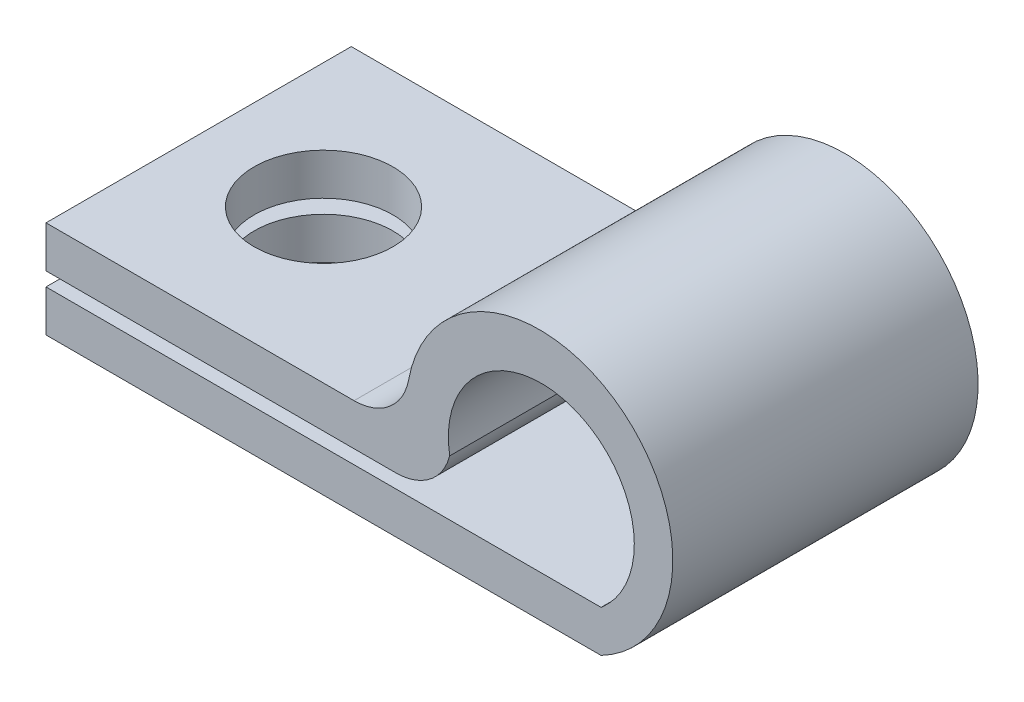
ISO-10303-21;
HEADER;
FILE_DESCRIPTION(('STEP AP214'),'2;1');
FILE_NAME('part.step','',(''),(''),'','','');
FILE_SCHEMA(('AUTOMOTIVE_DESIGN { 1 0 10303 214 1 1 1 1 }'));
ENDSEC;
DATA;
#1=APPLICATION_CONTEXT('core data for automotive mechanical design processes');
#2=APPLICATION_PROTOCOL_DEFINITION('international standard','automotive_design',2000,#1);
#3=PRODUCT_CONTEXT('',#1,'mechanical');
#4=PRODUCT('Part','Part','',(#3));
#5=PRODUCT_RELATED_PRODUCT_CATEGORY('part','',(#4));
#6=PRODUCT_DEFINITION_FORMATION('','',#4);
#7=PRODUCT_DEFINITION_CONTEXT('part definition',#1,'design');
#8=PRODUCT_DEFINITION('design','',#6,#7);
#9=PRODUCT_DEFINITION_SHAPE('','',#8);
#10=(LENGTH_UNIT() NAMED_UNIT(*) SI_UNIT(.MILLI.,.METRE.));
#11=(NAMED_UNIT(*) PLANE_ANGLE_UNIT() SI_UNIT($,.RADIAN.));
#12=(NAMED_UNIT(*) SI_UNIT($,.STERADIAN.) SOLID_ANGLE_UNIT());
#13=UNCERTAINTY_MEASURE_WITH_UNIT(LENGTH_MEASURE(1.E-05),#10,'distance_accuracy_value','');
#14=(GEOMETRIC_REPRESENTATION_CONTEXT(3) GLOBAL_UNCERTAINTY_ASSIGNED_CONTEXT((#13)) GLOBAL_UNIT_ASSIGNED_CONTEXT((#10,
#11,#12)) REPRESENTATION_CONTEXT('',''));
#15=CARTESIAN_POINT('',(0.,0.,0.));
#16=DIRECTION('',(0.,0.,1.));
#17=DIRECTION('',(1.,0.,0.));
#18=AXIS2_PLACEMENT_3D('',#15,#16,#17);
#19=CARTESIAN_POINT('',(0.,2.,11.));
#20=DIRECTION('',(0.,1.,0.));
#21=DIRECTION('',(0.,0.,1.));
#22=AXIS2_PLACEMENT_3D('',#19,#20,#21);
#23=PLANE('',#22);
#24=CARTESIAN_POINT('',(-15.5,2.,5.5));
#25=DIRECTION('',(0.,1.,0.));
#26=DIRECTION('',(0.,0.,1.));
#27=AXIS2_PLACEMENT_3D('',#24,#25,#26);
#28=CIRCLE('',#27,2.5);
#29=CARTESIAN_POINT('',(-15.5,2.,8.));
#30=VERTEX_POINT('',#29);
#31=EDGE_CURVE('E186',#30,#30,#28,.T.);
#32=ORIENTED_EDGE('',*,*,#31,.T.);
#33=EDGE_LOOP('',(#32));
#34=FACE_BOUND('',#33,.T.);
#35=DIRECTION('',(1.,0.,0.));
#36=VECTOR('',#35,1.);
#37=CARTESIAN_POINT('',(0.,2.,0.));
#38=LINE('',#37,#36);
#39=CARTESIAN_POINT('',(-20.,2.,0.));
#40=VERTEX_POINT('',#39);
#41=CARTESIAN_POINT('',(-7.39029966919305,2.,0.));
#42=VERTEX_POINT('',#41);
#43=EDGE_CURVE('E182',#40,#42,#38,.T.);
#44=ORIENTED_EDGE('',*,*,#43,.T.);
#45=DIRECTION('',(0.,0.,-1.));
#46=VECTOR('',#45,1.);
#47=CARTESIAN_POINT('',(-7.39029966919305,2.,11.));
#48=LINE('',#47,#46);
#49=CARTESIAN_POINT('',(-7.39029966919305,2.,11.));
#50=VERTEX_POINT('',#49);
#51=EDGE_CURVE('E123',#42,#50,#48,.F.);
#52=ORIENTED_EDGE('',*,*,#51,.T.);
#53=DIRECTION('',(1.,0.,0.));
#54=VECTOR('',#53,1.);
#55=CARTESIAN_POINT('',(0.,2.,11.));
#56=LINE('',#55,#54);
#57=CARTESIAN_POINT('',(-20.,2.,11.));
#58=VERTEX_POINT('',#57);
#59=EDGE_CURVE('E118',#58,#50,#56,.T.);
#60=ORIENTED_EDGE('',*,*,#59,.F.);
#61=DIRECTION('',(0.,0.,-1.));
#62=VECTOR('',#61,1.);
#63=CARTESIAN_POINT('',(-20.,2.,11.));
#64=LINE('',#63,#62);
#65=EDGE_CURVE('E176',#58,#40,#64,.T.);
#66=ORIENTED_EDGE('',*,*,#65,.T.);
#67=EDGE_LOOP('',(#44,#52,#60,#66));
#68=FACE_BOUND('',#67,.T.);
#69=ADVANCED_FACE('F35',(#34,#68),#23,.F.);
#70=CARTESIAN_POINT('',(-2.15217822005377,4.06722202178273,11.));
#71=DIRECTION('',(0.,0.,-1.));
#72=DIRECTION('',(-1.,0.,0.));
#73=AXIS2_PLACEMENT_3D('',#70,#71,#72);
#74=CYLINDRICAL_SURFACE('',#73,3.35);
#75=CARTESIAN_POINT('',(-2.15217822005377,4.06722202178273,0.));
#76=DIRECTION('',(0.,0.,1.));
#77=DIRECTION('',(1.,0.,0.));
#78=AXIS2_PLACEMENT_3D('',#75,#76,#77);
#79=CIRCLE('',#78,3.35);
#80=CARTESIAN_POINT('',(-5.45380799608934,3.5,0.));
#81=VERTEX_POINT('',#80);
#82=CARTESIAN_POINT('',(0.,1.5,0.));
#83=VERTEX_POINT('',#82);
#84=EDGE_CURVE('E185',#81,#83,#79,.F.);
#85=ORIENTED_EDGE('',*,*,#84,.T.);
#86=DIRECTION('',(0.,0.,-1.));
#87=VECTOR('',#86,1.);
#88=CARTESIAN_POINT('',(0.,1.5,11.));
#89=LINE('',#88,#87);
#90=CARTESIAN_POINT('',(0.,1.5,11.));
#91=VERTEX_POINT('',#90);
#92=EDGE_CURVE('E131',#91,#83,#89,.T.);
#93=ORIENTED_EDGE('',*,*,#92,.F.);
#94=CARTESIAN_POINT('',(-2.15217822005377,4.06722202178273,11.));
#95=DIRECTION('',(0.,0.,1.));
#96=DIRECTION('',(1.,0.,0.));
#97=AXIS2_PLACEMENT_3D('',#94,#95,#96);
#98=CIRCLE('',#97,3.35);
#99=CARTESIAN_POINT('',(-5.45380799608934,3.5,11.));
#100=VERTEX_POINT('',#99);
#101=EDGE_CURVE('E114',#100,#91,#98,.F.);
#102=ORIENTED_EDGE('',*,*,#101,.F.);
#103=DIRECTION('',(0.,0.,-1.));
#104=VECTOR('',#103,1.);
#105=CARTESIAN_POINT('',(-5.45380799608934,3.5,11.));
#106=LINE('',#105,#104);
#107=EDGE_CURVE('E128',#100,#81,#106,.T.);
#108=ORIENTED_EDGE('',*,*,#107,.T.);
#109=EDGE_LOOP('',(#85,#93,#102,#108));
#110=FACE_BOUND('',#109,.T.);
#111=ADVANCED_FACE('F127',(#110),#74,.F.);
#112=CARTESIAN_POINT('',(0.,1.5,11.));
#113=DIRECTION('',(0.,-1.,0.));
#114=DIRECTION('',(1.,0.,0.));
#115=AXIS2_PLACEMENT_3D('',#112,#113,#114);
#116=PLANE('',#115);
#117=CARTESIAN_POINT('',(-15.5,1.5,5.5));
#118=DIRECTION('',(0.,-1.,0.));
#119=DIRECTION('',(1.,0.,0.));
#120=AXIS2_PLACEMENT_3D('',#117,#118,#119);
#121=CIRCLE('',#120,2.5);
#122=CARTESIAN_POINT('',(-13.,1.5,5.5));
#123=VERTEX_POINT('',#122);
#124=EDGE_CURVE('E145',#123,#123,#121,.T.);
#125=ORIENTED_EDGE('',*,*,#124,.T.);
#126=EDGE_LOOP('',(#125));
#127=FACE_BOUND('',#126,.T.);
#128=DIRECTION('',(-1.,0.,0.));
#129=VECTOR('',#128,1.);
#130=CARTESIAN_POINT('',(0.,1.5,0.));
#131=LINE('',#130,#129);
#132=CARTESIAN_POINT('',(-20.,1.5,0.));
#133=VERTEX_POINT('',#132);
#134=EDGE_CURVE('E188',#83,#133,#131,.T.);
#135=ORIENTED_EDGE('',*,*,#134,.T.);
#136=DIRECTION('',(0.,0.,-1.));
#137=VECTOR('',#136,1.);
#138=CARTESIAN_POINT('',(-20.,1.5,11.));
#139=LINE('',#138,#137);
#140=CARTESIAN_POINT('',(-20.,1.5,11.));
#141=VERTEX_POINT('',#140);
#142=EDGE_CURVE('E139',#141,#133,#139,.T.);
#143=ORIENTED_EDGE('',*,*,#142,.F.);
#144=DIRECTION('',(-1.,0.,0.));
#145=VECTOR('',#144,1.);
#146=CARTESIAN_POINT('',(0.,1.5,11.));
#147=LINE('',#146,#145);
#148=EDGE_CURVE('E133',#91,#141,#147,.T.);
#149=ORIENTED_EDGE('',*,*,#148,.F.);
#150=ORIENTED_EDGE('',*,*,#92,.T.);
#151=EDGE_LOOP('',(#135,#143,#149,#150));
#152=FACE_BOUND('',#151,.T.);
#153=ADVANCED_FACE('F211',(#127,#152),#116,.F.);
#154=CARTESIAN_POINT('',(-20.,0.,11.));
#155=DIRECTION('',(-1.,0.,0.));
#156=DIRECTION('',(0.,0.,1.));
#157=AXIS2_PLACEMENT_3D('',#154,#155,#156);
#158=PLANE('',#157);
#159=DIRECTION('',(0.,1.,0.));
#160=VECTOR('',#159,1.);
#161=CARTESIAN_POINT('',(-20.,0.,0.));
#162=LINE('',#161,#160);
#163=CARTESIAN_POINT('',(-20.,0.,0.));
#164=VERTEX_POINT('',#163);
#165=EDGE_CURVE('E191',#164,#133,#162,.T.);
#166=ORIENTED_EDGE('',*,*,#165,.F.);
#167=DIRECTION('',(0.,0.,-1.));
#168=VECTOR('',#167,1.);
#169=CARTESIAN_POINT('',(-20.,0.,11.));
#170=LINE('',#169,#168);
#171=CARTESIAN_POINT('',(-20.,0.,11.));
#172=VERTEX_POINT('',#171);
#173=EDGE_CURVE('E201',#172,#164,#170,.T.);
#174=ORIENTED_EDGE('',*,*,#173,.F.);
#175=DIRECTION('',(0.,1.,0.));
#176=VECTOR('',#175,1.);
#177=CARTESIAN_POINT('',(-20.,0.,11.));
#178=LINE('',#177,#176);
#179=EDGE_CURVE('E208',#172,#141,#178,.T.);
#180=ORIENTED_EDGE('',*,*,#179,.T.);
#181=ORIENTED_EDGE('',*,*,#142,.T.);
#182=EDGE_LOOP('',(#166,#174,#180,#181));
#183=FACE_BOUND('',#182,.T.);
#184=ADVANCED_FACE('F206',(#183),#158,.T.);
#185=CARTESIAN_POINT('',(0.,0.,11.));
#186=DIRECTION('',(0.,-1.,0.));
#187=DIRECTION('',(1.,0.,0.));
#188=AXIS2_PLACEMENT_3D('',#185,#186,#187);
#189=PLANE('',#188);
#190=CARTESIAN_POINT('',(-15.5,0.,5.5));
#191=DIRECTION('',(0.,-1.,0.));
#192=DIRECTION('',(1.,0.,0.));
#193=AXIS2_PLACEMENT_3D('',#190,#191,#192);
#194=CIRCLE('',#193,2.5);
#195=CARTESIAN_POINT('',(-13.,0.,5.5));
#196=VERTEX_POINT('',#195);
#197=EDGE_CURVE('E146',#196,#196,#194,.T.);
#198=ORIENTED_EDGE('',*,*,#197,.F.);
#199=EDGE_LOOP('',(#198));
#200=FACE_BOUND('',#199,.T.);
#201=DIRECTION('',(-1.,0.,0.));
#202=VECTOR('',#201,1.);
#203=CARTESIAN_POINT('',(0.,0.,0.));
#204=LINE('',#203,#202);
#205=CARTESIAN_POINT('',(0.,0.,0.));
#206=VERTEX_POINT('',#205);
#207=EDGE_CURVE('E166',#206,#164,#204,.T.);
#208=ORIENTED_EDGE('',*,*,#207,.F.);
#209=DIRECTION('',(0.,0.,-1.));
#210=VECTOR('',#209,1.);
#211=CARTESIAN_POINT('',(0.,0.,11.));
#212=LINE('',#211,#210);
#213=CARTESIAN_POINT('',(0.,0.,11.));
#214=VERTEX_POINT('',#213);
#215=EDGE_CURVE('E164',#214,#206,#212,.T.);
#216=ORIENTED_EDGE('',*,*,#215,.F.);
#217=DIRECTION('',(-1.,0.,0.));
#218=VECTOR('',#217,1.);
#219=CARTESIAN_POINT('',(0.,0.,11.));
#220=LINE('',#219,#218);
#221=EDGE_CURVE('E178',#214,#172,#220,.T.);
#222=ORIENTED_EDGE('',*,*,#221,.T.);
#223=ORIENTED_EDGE('',*,*,#173,.T.);
#224=EDGE_LOOP('',(#208,#216,#222,#223));
#225=FACE_BOUND('',#224,.T.);
#226=ADVANCED_FACE('F213',(#200,#225),#189,.T.);
#227=CARTESIAN_POINT('',(-2.21416599914087,4.25881074106945,11.));
#228=DIRECTION('',(0.,0.,-1.));
#229=DIRECTION('',(-1.,0.,0.));
#230=AXIS2_PLACEMENT_3D('',#227,#228,#229);
#231=CYLINDRICAL_SURFACE('',#230,4.8);
#232=CARTESIAN_POINT('',(-2.21416599914087,4.25881074106945,0.));
#233=DIRECTION('',(0.,0.,1.));
#234=DIRECTION('',(1.,0.,0.));
#235=AXIS2_PLACEMENT_3D('',#232,#233,#234);
#236=CIRCLE('',#235,4.8);
#237=CARTESIAN_POINT('',(-6.93352929565872,5.13494433560866,0.));
#238=VERTEX_POINT('',#237);
#239=EDGE_CURVE('E155',#238,#206,#236,.F.);
#240=ORIENTED_EDGE('',*,*,#239,.F.);
#241=DIRECTION('',(0.,0.,-1.));
#242=VECTOR('',#241,1.);
#243=CARTESIAN_POINT('',(-6.93352929565872,5.13494433560866,11.));
#244=LINE('',#243,#242);
#245=CARTESIAN_POINT('',(-6.93352929565872,5.13494433560866,11.));
#246=VERTEX_POINT('',#245);
#247=EDGE_CURVE('E56',#238,#246,#244,.F.);
#248=ORIENTED_EDGE('',*,*,#247,.T.);
#249=CARTESIAN_POINT('',(-2.21416599914087,4.25881074106945,11.));
#250=DIRECTION('',(0.,0.,1.));
#251=DIRECTION('',(1.,0.,0.));
#252=AXIS2_PLACEMENT_3D('',#249,#250,#251);
#253=CIRCLE('',#252,4.8);
#254=EDGE_CURVE('E174',#246,#214,#253,.F.);
#255=ORIENTED_EDGE('',*,*,#254,.T.);
#256=ORIENTED_EDGE('',*,*,#215,.T.);
#257=EDGE_LOOP('',(#240,#248,#255,#256));
#258=FACE_BOUND('',#257,.T.);
#259=ADVANCED_FACE('F162',(#258),#231,.T.);
#260=CARTESIAN_POINT('',(0.,3.5,11.));
#261=DIRECTION('',(0.,1.,0.));
#262=DIRECTION('',(0.,0.,1.));
#263=AXIS2_PLACEMENT_3D('',#260,#261,#262);
#264=PLANE('',#263);
#265=CARTESIAN_POINT('',(-15.5,3.5,5.5));
#266=DIRECTION('',(0.,1.,0.));
#267=DIRECTION('',(0.,0.,1.));
#268=AXIS2_PLACEMENT_3D('',#265,#266,#267);
#269=CIRCLE('',#268,2.5);
#270=CARTESIAN_POINT('',(-15.5,3.5,8.));
#271=VERTEX_POINT('',#270);
#272=EDGE_CURVE('E143',#271,#271,#269,.T.);
#273=ORIENTED_EDGE('',*,*,#272,.F.);
#274=EDGE_LOOP('',(#273));
#275=FACE_BOUND('',#274,.T.);
#276=DIRECTION('',(1.,0.,0.));
#277=VECTOR('',#276,1.);
#278=CARTESIAN_POINT('',(0.,3.5,11.));
#279=LINE('',#278,#277);
#280=CARTESIAN_POINT('',(-20.,3.5,11.));
#281=VERTEX_POINT('',#280);
#282=CARTESIAN_POINT('',(-8.89993066920782,3.5,11.));
#283=VERTEX_POINT('',#282);
#284=EDGE_CURVE('E170',#281,#283,#279,.T.);
#285=ORIENTED_EDGE('',*,*,#284,.T.);
#286=DIRECTION('',(0.,0.,1.));
#287=VECTOR('',#286,1.);
#288=CARTESIAN_POINT('',(-8.89993066920782,3.5,0.));
#289=LINE('',#288,#287);
#290=CARTESIAN_POINT('',(-8.89993066920782,3.5,0.));
#291=VERTEX_POINT('',#290);
#292=EDGE_CURVE('E122',#283,#291,#289,.F.);
#293=ORIENTED_EDGE('',*,*,#292,.T.);
#294=DIRECTION('',(1.,0.,0.));
#295=VECTOR('',#294,1.);
#296=CARTESIAN_POINT('',(0.,3.5,0.));
#297=LINE('',#296,#295);
#298=CARTESIAN_POINT('',(-20.,3.5,0.));
#299=VERTEX_POINT('',#298);
#300=EDGE_CURVE('E159',#299,#291,#297,.T.);
#301=ORIENTED_EDGE('',*,*,#300,.F.);
#302=DIRECTION('',(0.,0.,-1.));
#303=VECTOR('',#302,1.);
#304=CARTESIAN_POINT('',(-20.,3.5,11.));
#305=LINE('',#304,#303);
#306=EDGE_CURVE('E171',#281,#299,#305,.T.);
#307=ORIENTED_EDGE('',*,*,#306,.F.);
#308=EDGE_LOOP('',(#285,#293,#301,#307));
#309=FACE_BOUND('',#308,.T.);
#310=ADVANCED_FACE('F169',(#275,#309),#264,.T.);
#311=CARTESIAN_POINT('',(-20.,0.,11.));
#312=DIRECTION('',(-1.,0.,0.));
#313=DIRECTION('',(0.,0.,1.));
#314=AXIS2_PLACEMENT_3D('',#311,#312,#313);
#315=PLANE('',#314);
#316=DIRECTION('',(0.,1.,0.));
#317=VECTOR('',#316,1.);
#318=CARTESIAN_POINT('',(-20.,0.,0.));
#319=LINE('',#318,#317);
#320=EDGE_CURVE('E196',#40,#299,#319,.T.);
#321=ORIENTED_EDGE('',*,*,#320,.F.);
#322=ORIENTED_EDGE('',*,*,#65,.F.);
#323=DIRECTION('',(0.,1.,0.));
#324=VECTOR('',#323,1.);
#325=CARTESIAN_POINT('',(-20.,0.,11.));
#326=LINE('',#325,#324);
#327=EDGE_CURVE('E173',#58,#281,#326,.T.);
#328=ORIENTED_EDGE('',*,*,#327,.T.);
#329=ORIENTED_EDGE('',*,*,#306,.T.);
#330=EDGE_LOOP('',(#321,#322,#328,#329));
#331=FACE_BOUND('',#330,.T.);
#332=ADVANCED_FACE('F262',(#331),#315,.T.);
#333=CARTESIAN_POINT('',(0.,0.,11.));
#334=DIRECTION('',(0.,0.,1.));
#335=DIRECTION('',(1.,0.,0.));
#336=AXIS2_PLACEMENT_3D('',#333,#334,#335);
#337=PLANE('',#336);
#338=ORIENTED_EDGE('',*,*,#59,.T.);
#339=CARTESIAN_POINT('',(-7.39029966919305,4.,11.));
#340=DIRECTION('',(0.,0.,1.));
#341=DIRECTION('',(1.,0.,0.));
#342=AXIS2_PLACEMENT_3D('',#339,#340,#341);
#343=CIRCLE('',#342,2.);
#344=EDGE_CURVE('E111',#50,#100,#343,.T.);
#345=ORIENTED_EDGE('',*,*,#344,.T.);
#346=ORIENTED_EDGE('',*,*,#101,.T.);
#347=ORIENTED_EDGE('',*,*,#148,.T.);
#348=ORIENTED_EDGE('',*,*,#179,.F.);
#349=ORIENTED_EDGE('',*,*,#221,.F.);
#350=ORIENTED_EDGE('',*,*,#254,.F.);
#351=CARTESIAN_POINT('',(-8.89993066920782,5.5,11.));
#352=DIRECTION('',(0.,0.,1.));
#353=DIRECTION('',(1.,0.,0.));
#354=AXIS2_PLACEMENT_3D('',#351,#352,#353);
#355=CIRCLE('',#354,2.);
#356=EDGE_CURVE('E11',#246,#283,#355,.F.);
#357=ORIENTED_EDGE('',*,*,#356,.T.);
#358=ORIENTED_EDGE('',*,*,#284,.F.);
#359=ORIENTED_EDGE('',*,*,#327,.F.);
#360=EDGE_LOOP('',(#338,#345,#346,#347,#348,#349,#350,#357,#358,#359));
#361=FACE_BOUND('',#360,.T.);
#362=ADVANCED_FACE('F113',(#361),#337,.T.);
#363=CARTESIAN_POINT('',(0.,0.,0.));
#364=DIRECTION('',(0.,0.,1.));
#365=DIRECTION('',(1.,0.,0.));
#366=AXIS2_PLACEMENT_3D('',#363,#364,#365);
#367=PLANE('',#366);
#368=ORIENTED_EDGE('',*,*,#84,.F.);
#369=CARTESIAN_POINT('',(-7.39029966919305,4.,0.));
#370=DIRECTION('',(0.,0.,1.));
#371=DIRECTION('',(1.,0.,0.));
#372=AXIS2_PLACEMENT_3D('',#369,#370,#371);
#373=CIRCLE('',#372,2.);
#374=EDGE_CURVE('E136',#81,#42,#373,.F.);
#375=ORIENTED_EDGE('',*,*,#374,.T.);
#376=ORIENTED_EDGE('',*,*,#43,.F.);
#377=ORIENTED_EDGE('',*,*,#320,.T.);
#378=ORIENTED_EDGE('',*,*,#300,.T.);
#379=CARTESIAN_POINT('',(-8.89993066920782,5.5,0.));
#380=DIRECTION('',(0.,0.,1.));
#381=DIRECTION('',(1.,0.,0.));
#382=AXIS2_PLACEMENT_3D('',#379,#380,#381);
#383=CIRCLE('',#382,2.);
#384=EDGE_CURVE('E43',#291,#238,#383,.T.);
#385=ORIENTED_EDGE('',*,*,#384,.T.);
#386=ORIENTED_EDGE('',*,*,#239,.T.);
#387=ORIENTED_EDGE('',*,*,#207,.T.);
#388=ORIENTED_EDGE('',*,*,#165,.T.);
#389=ORIENTED_EDGE('',*,*,#134,.F.);
#390=EDGE_LOOP('',(#368,#375,#376,#377,#378,#385,#386,#387,#388,#389));
#391=FACE_BOUND('',#390,.T.);
#392=ADVANCED_FACE('F153',(#391),#367,.F.);
#393=CARTESIAN_POINT('',(-15.5,9.05881074106945,5.5));
#394=DIRECTION('',(0.,-1.,0.));
#395=DIRECTION('',(1.,0.,0.));
#396=AXIS2_PLACEMENT_3D('',#393,#394,#395);
#397=CYLINDRICAL_SURFACE('',#396,2.5);
#398=ORIENTED_EDGE('',*,*,#272,.T.);
#399=EDGE_LOOP('',(#398));
#400=FACE_BOUND('',#399,.T.);
#401=ORIENTED_EDGE('',*,*,#31,.F.);
#402=EDGE_LOOP('',(#401));
#403=FACE_BOUND('',#402,.T.);
#404=ADVANCED_FACE('F254',(#400,#403),#397,.F.);
#405=ORIENTED_EDGE('',*,*,#197,.T.);
#406=EDGE_LOOP('',(#405));
#407=FACE_BOUND('',#406,.T.);
#408=ORIENTED_EDGE('',*,*,#124,.F.);
#409=EDGE_LOOP('',(#408));
#410=FACE_BOUND('',#409,.T.);
#411=ADVANCED_FACE('F227',(#407,#410),#397,.F.);
#412=CARTESIAN_POINT('',(-7.39029966919305,4.,11.));
#413=DIRECTION('',(0.,0.,-1.));
#414=DIRECTION('',(-1.,0.,0.));
#415=AXIS2_PLACEMENT_3D('',#412,#413,#414);
#416=CYLINDRICAL_SURFACE('',#415,2.);
#417=ORIENTED_EDGE('',*,*,#344,.F.);
#418=ORIENTED_EDGE('',*,*,#51,.F.);
#419=ORIENTED_EDGE('',*,*,#374,.F.);
#420=ORIENTED_EDGE('',*,*,#107,.F.);
#421=EDGE_LOOP('',(#417,#418,#419,#420));
#422=FACE_BOUND('',#421,.T.);
#423=ADVANCED_FACE('F135',(#422),#416,.T.);
#424=CARTESIAN_POINT('',(-8.89993066920782,5.5,11.));
#425=DIRECTION('',(0.,0.,-1.));
#426=DIRECTION('',(-1.,0.,0.));
#427=AXIS2_PLACEMENT_3D('',#424,#425,#426);
#428=CYLINDRICAL_SURFACE('',#427,2.);
#429=ORIENTED_EDGE('',*,*,#356,.F.);
#430=ORIENTED_EDGE('',*,*,#247,.F.);
#431=ORIENTED_EDGE('',*,*,#384,.F.);
#432=ORIENTED_EDGE('',*,*,#292,.F.);
#433=EDGE_LOOP('',(#429,#430,#431,#432));
#434=FACE_BOUND('',#433,.T.);
#435=ADVANCED_FACE('F37',(#434),#428,.F.);
#436=CLOSED_SHELL('',(#69,#111,#153,#184,#226,#259,#310,#332,#362,#392,#404,#411,#423,#435));
#437=MANIFOLD_SOLID_BREP('B2',#436);
#438=ADVANCED_BREP_SHAPE_REPRESENTATION('',(#18,#437),#14);
#439=SHAPE_DEFINITION_REPRESENTATION(#9,#438);
ENDSEC;
END-ISO-10303-21;
